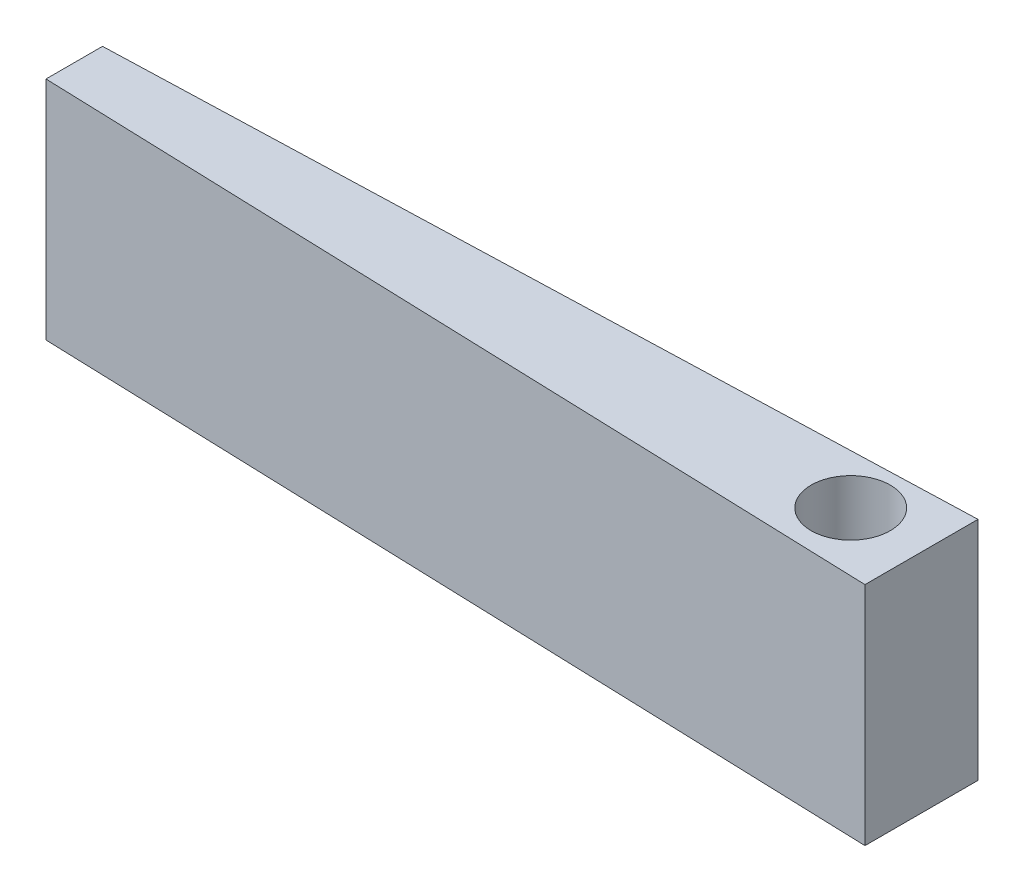
ISO-10303-21;
HEADER;
FILE_DESCRIPTION(('STEP AP214'),'2;1');
FILE_NAME('part.step','',(''),(''),'','','');
FILE_SCHEMA(('AUTOMOTIVE_DESIGN { 1 0 10303 214 1 1 1 1 }'));
ENDSEC;
DATA;
#1=APPLICATION_CONTEXT('core data for automotive mechanical design processes');
#2=APPLICATION_PROTOCOL_DEFINITION('international standard','automotive_design',2000,#1);
#3=PRODUCT_CONTEXT('',#1,'mechanical');
#4=PRODUCT('Part','Part','',(#3));
#5=PRODUCT_RELATED_PRODUCT_CATEGORY('part','',(#4));
#6=PRODUCT_DEFINITION_FORMATION('','',#4);
#7=PRODUCT_DEFINITION_CONTEXT('part definition',#1,'design');
#8=PRODUCT_DEFINITION('design','',#6,#7);
#9=PRODUCT_DEFINITION_SHAPE('','',#8);
#10=(LENGTH_UNIT() NAMED_UNIT(*) SI_UNIT(.MILLI.,.METRE.));
#11=(NAMED_UNIT(*) PLANE_ANGLE_UNIT() SI_UNIT($,.RADIAN.));
#12=(NAMED_UNIT(*) SI_UNIT($,.STERADIAN.) SOLID_ANGLE_UNIT());
#13=UNCERTAINTY_MEASURE_WITH_UNIT(LENGTH_MEASURE(1.E-05),#10,'distance_accuracy_value','');
#14=(GEOMETRIC_REPRESENTATION_CONTEXT(3) GLOBAL_UNCERTAINTY_ASSIGNED_CONTEXT((#13)) GLOBAL_UNIT_ASSIGNED_CONTEXT((#10,
#11,#12)) REPRESENTATION_CONTEXT('',''));
#15=CARTESIAN_POINT('',(0.,0.,0.));
#16=DIRECTION('',(0.,0.,1.));
#17=DIRECTION('',(1.,0.,0.));
#18=AXIS2_PLACEMENT_3D('',#15,#16,#17);
#19=CARTESIAN_POINT('',(-46.9032410837126,40.,0.468259604190913));
#20=DIRECTION('',(0.0331551783885263,0.,0.999450215941757));
#21=DIRECTION('',(0.999450215941757,0.,-0.0331551783885263));
#22=AXIS2_PLACEMENT_3D('',#19,#20,#21);
#23=PLANE('',#22);
#24=DIRECTION('',(-0.999450215941757,0.,0.0331551783885263));
#25=VECTOR('',#24,1.);
#26=CARTESIAN_POINT('',(-46.9032410837126,0.,0.468259604190913));
#27=LINE('',#26,#25);
#28=CARTESIAN_POINT('',(103.014291307551,0.,-4.50501715408803));
#29=VERTEX_POINT('',#28);
#30=CARTESIAN_POINT('',(-46.9032410837126,0.,0.468259604190913));
#31=VERTEX_POINT('',#30);
#32=EDGE_CURVE('E107',#29,#31,#27,.T.);
#33=ORIENTED_EDGE('',*,*,#32,.T.);
#34=DIRECTION('',(0.,-1.,0.));
#35=VECTOR('',#34,1.);
#36=CARTESIAN_POINT('',(-46.9032410837126,40.,0.468259604190913));
#37=LINE('',#36,#35);
#38=CARTESIAN_POINT('',(-46.9032410837126,40.,0.468259604190913));
#39=VERTEX_POINT('',#38);
#40=EDGE_CURVE('E11',#39,#31,#37,.T.);
#41=ORIENTED_EDGE('',*,*,#40,.F.);
#42=DIRECTION('',(-0.999450215941757,0.,0.0331551783885263));
#43=VECTOR('',#42,1.);
#44=CARTESIAN_POINT('',(-46.9032410837126,40.,0.468259604190913));
#45=LINE('',#44,#43);
#46=CARTESIAN_POINT('',(103.014291307551,40.,-4.50501715408803));
#47=VERTEX_POINT('',#46);
#48=EDGE_CURVE('E91',#47,#39,#45,.T.);
#49=ORIENTED_EDGE('',*,*,#48,.F.);
#50=DIRECTION('',(0.,-1.,0.));
#51=VECTOR('',#50,1.);
#52=CARTESIAN_POINT('',(103.014291307551,40.,-4.50501715408803));
#53=LINE('',#52,#51);
#54=EDGE_CURVE('E103',#47,#29,#53,.T.);
#55=ORIENTED_EDGE('',*,*,#54,.T.);
#56=EDGE_LOOP('',(#33,#41,#49,#55));
#57=FACE_BOUND('',#56,.T.);
#58=ADVANCED_FACE('F39',(#57),#23,.F.);
#59=CARTESIAN_POINT('',(-46.9032410837126,40.,0.468259604190913));
#60=DIRECTION('',(1.,0.,0.));
#61=DIRECTION('',(0.,0.,-1.));
#62=AXIS2_PLACEMENT_3D('',#59,#60,#61);
#63=PLANE('',#62);
#64=DIRECTION('',(0.,0.,1.));
#65=VECTOR('',#64,1.);
#66=CARTESIAN_POINT('',(-46.9032410837126,0.,0.468259604190913));
#67=LINE('',#66,#65);
#68=CARTESIAN_POINT('',(-46.9032410837126,0.,10.4682596041909));
#69=VERTEX_POINT('',#68);
#70=EDGE_CURVE('E96',#31,#69,#67,.T.);
#71=ORIENTED_EDGE('',*,*,#70,.T.);
#72=DIRECTION('',(0.,-1.,0.));
#73=VECTOR('',#72,1.);
#74=CARTESIAN_POINT('',(-46.9032410837126,40.,10.4682596041909));
#75=LINE('',#74,#73);
#76=CARTESIAN_POINT('',(-46.9032410837126,40.,10.4682596041909));
#77=VERTEX_POINT('',#76);
#78=EDGE_CURVE('E48',#77,#69,#75,.T.);
#79=ORIENTED_EDGE('',*,*,#78,.F.);
#80=DIRECTION('',(0.,0.,1.));
#81=VECTOR('',#80,1.);
#82=CARTESIAN_POINT('',(-46.9032410837126,40.,0.468259604190913));
#83=LINE('',#82,#81);
#84=EDGE_CURVE('E86',#39,#77,#83,.T.);
#85=ORIENTED_EDGE('',*,*,#84,.F.);
#86=ORIENTED_EDGE('',*,*,#40,.T.);
#87=EDGE_LOOP('',(#71,#79,#85,#86));
#88=FACE_BOUND('',#87,.T.);
#89=ADVANCED_FACE('F95',(#88),#63,.F.);
#90=CARTESIAN_POINT('',(103.014291307551,40.,15.494982845912));
#91=DIRECTION('',(0.0335110902694081,0.,-0.999438345686694));
#92=DIRECTION('',(-0.999438345686694,0.,-0.0335110902694081));
#93=AXIS2_PLACEMENT_3D('',#90,#91,#92);
#94=PLANE('',#93);
#95=DIRECTION('',(0.999438345686694,0.,0.0335110902694081));
#96=VECTOR('',#95,1.);
#97=CARTESIAN_POINT('',(103.014291307551,0.,15.494982845912));
#98=LINE('',#97,#96);
#99=CARTESIAN_POINT('',(103.014291307551,0.,15.494982845912));
#100=VERTEX_POINT('',#99);
#101=EDGE_CURVE('E73',#69,#100,#98,.T.);
#102=ORIENTED_EDGE('',*,*,#101,.T.);
#103=DIRECTION('',(0.,-1.,0.));
#104=VECTOR('',#103,1.);
#105=CARTESIAN_POINT('',(103.014291307551,40.,15.494982845912));
#106=LINE('',#105,#104);
#107=CARTESIAN_POINT('',(103.014291307551,40.,15.494982845912));
#108=VERTEX_POINT('',#107);
#109=EDGE_CURVE('E98',#108,#100,#106,.T.);
#110=ORIENTED_EDGE('',*,*,#109,.F.);
#111=DIRECTION('',(0.999438345686694,0.,0.0335110902694081));
#112=VECTOR('',#111,1.);
#113=CARTESIAN_POINT('',(103.014291307551,40.,15.494982845912));
#114=LINE('',#113,#112);
#115=EDGE_CURVE('E89',#77,#108,#114,.T.);
#116=ORIENTED_EDGE('',*,*,#115,.F.);
#117=ORIENTED_EDGE('',*,*,#78,.T.);
#118=EDGE_LOOP('',(#102,#110,#116,#117));
#119=FACE_BOUND('',#118,.T.);
#120=ADVANCED_FACE('F99',(#119),#94,.F.);
#121=CARTESIAN_POINT('',(103.014291307551,40.,-4.50501715408803));
#122=DIRECTION('',(-1.,0.,0.));
#123=DIRECTION('',(0.,0.,1.));
#124=AXIS2_PLACEMENT_3D('',#121,#122,#123);
#125=PLANE('',#124);
#126=DIRECTION('',(0.,0.,-1.));
#127=VECTOR('',#126,1.);
#128=CARTESIAN_POINT('',(103.014291307551,0.,-4.50501715408803));
#129=LINE('',#128,#127);
#130=EDGE_CURVE('E79',#100,#29,#129,.T.);
#131=ORIENTED_EDGE('',*,*,#130,.T.);
#132=ORIENTED_EDGE('',*,*,#54,.F.);
#133=DIRECTION('',(0.,0.,-1.));
#134=VECTOR('',#133,1.);
#135=CARTESIAN_POINT('',(103.014291307551,40.,-4.50501715408803));
#136=LINE('',#135,#134);
#137=EDGE_CURVE('E56',#108,#47,#136,.T.);
#138=ORIENTED_EDGE('',*,*,#137,.F.);
#139=ORIENTED_EDGE('',*,*,#109,.T.);
#140=EDGE_LOOP('',(#131,#132,#138,#139));
#141=FACE_BOUND('',#140,.T.);
#142=ADVANCED_FACE('F121',(#141),#125,.F.);
#143=CARTESIAN_POINT('',(0.,40.,0.));
#144=DIRECTION('',(0.,-1.,0.));
#145=DIRECTION('',(0.,0.,-1.));
#146=AXIS2_PLACEMENT_3D('',#143,#144,#145);
#147=PLANE('',#146);
#148=CARTESIAN_POINT('',(90.,40.,5.));
#149=DIRECTION('',(0.,1.,0.));
#150=DIRECTION('',(0.,0.,1.));
#151=AXIS2_PLACEMENT_3D('',#148,#149,#150);
#152=CIRCLE('',#151,7.);
#153=CARTESIAN_POINT('',(90.,40.,12.));
#154=VERTEX_POINT('',#153);
#155=EDGE_CURVE('E128',#154,#154,#152,.T.);
#156=ORIENTED_EDGE('',*,*,#155,.F.);
#157=EDGE_LOOP('',(#156));
#158=FACE_BOUND('',#157,.T.);
#159=ORIENTED_EDGE('',*,*,#48,.T.);
#160=ORIENTED_EDGE('',*,*,#84,.T.);
#161=ORIENTED_EDGE('',*,*,#115,.T.);
#162=ORIENTED_EDGE('',*,*,#137,.T.);
#163=EDGE_LOOP('',(#159,#160,#161,#162));
#164=FACE_BOUND('',#163,.T.);
#165=ADVANCED_FACE('F87',(#158,#164),#147,.F.);
#166=CARTESIAN_POINT('',(0.,0.,0.));
#167=DIRECTION('',(0.,-1.,0.));
#168=DIRECTION('',(0.,0.,-1.));
#169=AXIS2_PLACEMENT_3D('',#166,#167,#168);
#170=PLANE('',#169);
#171=ORIENTED_EDGE('',*,*,#32,.F.);
#172=ORIENTED_EDGE('',*,*,#130,.F.);
#173=ORIENTED_EDGE('',*,*,#101,.F.);
#174=ORIENTED_EDGE('',*,*,#70,.F.);
#175=EDGE_LOOP('',(#171,#172,#173,#174));
#176=FACE_BOUND('',#175,.T.);
#177=ADVANCED_FACE('F124',(#176),#170,.T.);
#178=CARTESIAN_POINT('',(90.,15.,5.));
#179=DIRECTION('',(0.,1.,0.));
#180=DIRECTION('',(0.,0.,1.));
#181=AXIS2_PLACEMENT_3D('',#178,#179,#180);
#182=CYLINDRICAL_SURFACE('',#181,7.);
#183=CARTESIAN_POINT('',(90.,15.,5.));
#184=DIRECTION('',(0.,1.,0.));
#185=DIRECTION('',(0.,0.,1.));
#186=AXIS2_PLACEMENT_3D('',#183,#184,#185);
#187=CIRCLE('',#186,7.);
#188=CARTESIAN_POINT('',(90.,15.,12.));
#189=VERTEX_POINT('',#188);
#190=EDGE_CURVE('E111',#189,#189,#187,.T.);
#191=ORIENTED_EDGE('',*,*,#190,.F.);
#192=EDGE_LOOP('',(#191));
#193=FACE_BOUND('',#192,.T.);
#194=ORIENTED_EDGE('',*,*,#155,.T.);
#195=EDGE_LOOP('',(#194));
#196=FACE_BOUND('',#195,.T.);
#197=ADVANCED_FACE('F138',(#193,#196),#182,.F.);
#198=CARTESIAN_POINT('',(90.,15.,5.));
#199=DIRECTION('',(0.,1.,0.));
#200=DIRECTION('',(0.,0.,1.));
#201=AXIS2_PLACEMENT_3D('',#198,#199,#200);
#202=PLANE('',#201);
#203=ORIENTED_EDGE('',*,*,#190,.T.);
#204=EDGE_LOOP('',(#203));
#205=FACE_BOUND('',#204,.T.);
#206=ADVANCED_FACE('F136',(#205),#202,.T.);
#207=CLOSED_SHELL('',(#58,#89,#120,#142,#165,#177,#197,#206));
#208=MANIFOLD_SOLID_BREP('B2',#207);
#209=ADVANCED_BREP_SHAPE_REPRESENTATION('',(#18,#208),#14);
#210=SHAPE_DEFINITION_REPRESENTATION(#9,#209);
ENDSEC;
END-ISO-10303-21;
